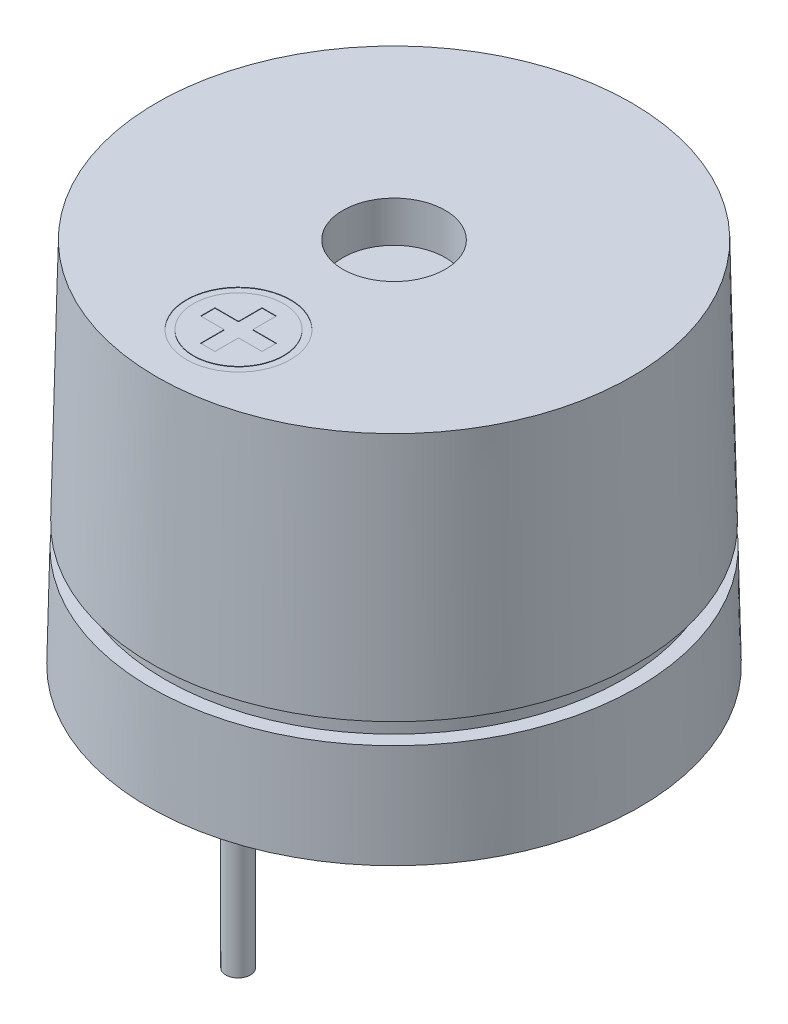
ISO-10303-21;
HEADER;
FILE_DESCRIPTION(('STEP AP214'),'2;1');
FILE_NAME('part.step','',(''),(''),'','','');
FILE_SCHEMA(('AUTOMOTIVE_DESIGN { 1 0 10303 214 1 1 1 1 }'));
ENDSEC;
DATA;
#1=APPLICATION_CONTEXT('core data for automotive mechanical design processes');
#2=APPLICATION_PROTOCOL_DEFINITION('international standard','automotive_design',2000,#1);
#3=PRODUCT_CONTEXT('',#1,'mechanical');
#4=PRODUCT('Part','Part','',(#3));
#5=PRODUCT_RELATED_PRODUCT_CATEGORY('part','',(#4));
#6=PRODUCT_DEFINITION_FORMATION('','',#4);
#7=PRODUCT_DEFINITION_CONTEXT('part definition',#1,'design');
#8=PRODUCT_DEFINITION('design','',#6,#7);
#9=PRODUCT_DEFINITION_SHAPE('','',#8);
#10=(LENGTH_UNIT() NAMED_UNIT(*) SI_UNIT(.MILLI.,.METRE.));
#11=(NAMED_UNIT(*) PLANE_ANGLE_UNIT() SI_UNIT($,.RADIAN.));
#12=(NAMED_UNIT(*) SI_UNIT($,.STERADIAN.) SOLID_ANGLE_UNIT());
#13=UNCERTAINTY_MEASURE_WITH_UNIT(LENGTH_MEASURE(1.E-05),#10,'distance_accuracy_value','');
#14=(GEOMETRIC_REPRESENTATION_CONTEXT(3) GLOBAL_UNCERTAINTY_ASSIGNED_CONTEXT((#13)) GLOBAL_UNIT_ASSIGNED_CONTEXT((#10,
#11,#12)) REPRESENTATION_CONTEXT('',''));
#15=CARTESIAN_POINT('',(0.,0.,0.));
#16=DIRECTION('',(0.,0.,1.));
#17=DIRECTION('',(1.,0.,0.));
#18=AXIS2_PLACEMENT_3D('',#15,#16,#17);
#19=CARTESIAN_POINT('',(0.,0.,0.));
#20=DIRECTION('',(0.,-1.,0.));
#21=DIRECTION('',(0.,0.,-1.));
#22=AXIS2_PLACEMENT_3D('',#19,#20,#21);
#23=CONICAL_SURFACE('',#22,6.,0.0222185653267191);
#24=CARTESIAN_POINT('',(0.,2.5,0.));
#25=DIRECTION('',(0.,-1.,0.));
#26=DIRECTION('',(1.,0.,0.));
#27=AXIS2_PLACEMENT_3D('',#24,#25,#26);
#28=CIRCLE('',#27,5.94444444444444);
#29=CARTESIAN_POINT('',(5.94444444444444,2.5,0.));
#30=VERTEX_POINT('',#29);
#31=EDGE_CURVE('E40',#30,#30,#28,.F.);
#32=ORIENTED_EDGE('',*,*,#31,.F.);
#33=EDGE_LOOP('',(#32));
#34=FACE_BOUND('',#33,.T.);
#35=CARTESIAN_POINT('',(0.,0.,0.));
#36=DIRECTION('',(0.,-1.,0.));
#37=DIRECTION('',(0.,0.,-1.));
#38=AXIS2_PLACEMENT_3D('',#35,#36,#37);
#39=CIRCLE('',#38,6.);
#40=CARTESIAN_POINT('',(0.,0.,-6.));
#41=VERTEX_POINT('',#40);
#42=EDGE_CURVE('E239',#41,#41,#39,.T.);
#43=ORIENTED_EDGE('',*,*,#42,.F.);
#44=EDGE_LOOP('',(#43));
#45=FACE_BOUND('',#44,.T.);
#46=ADVANCED_FACE('F36',(#34,#45),#23,.T.);
#47=CARTESIAN_POINT('',(0.,0.,0.));
#48=DIRECTION('',(0.,-1.,0.));
#49=DIRECTION('',(0.,0.,-1.));
#50=AXIS2_PLACEMENT_3D('',#47,#48,#49);
#51=PLANE('',#50);
#52=CARTESIAN_POINT('',(0.,0.,0.));
#53=DIRECTION('',(0.,-1.,0.));
#54=DIRECTION('',(0.,0.,-1.));
#55=AXIS2_PLACEMENT_3D('',#52,#53,#54);
#56=CIRCLE('',#55,5.4);
#57=CARTESIAN_POINT('',(0.,0.,-5.4));
#58=VERTEX_POINT('',#57);
#59=EDGE_CURVE('E230',#58,#58,#56,.T.);
#60=ORIENTED_EDGE('',*,*,#59,.F.);
#61=EDGE_LOOP('',(#60));
#62=FACE_BOUND('',#61,.T.);
#63=ORIENTED_EDGE('',*,*,#42,.T.);
#64=EDGE_LOOP('',(#63));
#65=FACE_BOUND('',#64,.T.);
#66=ADVANCED_FACE('F332',(#62,#65),#51,.T.);
#67=CARTESIAN_POINT('',(0.,0.5,0.));
#68=DIRECTION('',(0.,-1.,0.));
#69=DIRECTION('',(0.,0.,-1.));
#70=AXIS2_PLACEMENT_3D('',#67,#68,#69);
#71=CYLINDRICAL_SURFACE('',#70,5.4);
#72=CARTESIAN_POINT('',(0.,0.5,0.));
#73=DIRECTION('',(0.,-1.,0.));
#74=DIRECTION('',(0.,0.,-1.));
#75=AXIS2_PLACEMENT_3D('',#72,#73,#74);
#76=CIRCLE('',#75,5.4);
#77=CARTESIAN_POINT('',(0.,0.5,-5.4));
#78=VERTEX_POINT('',#77);
#79=EDGE_CURVE('E231',#78,#78,#76,.T.);
#80=ORIENTED_EDGE('',*,*,#79,.F.);
#81=EDGE_LOOP('',(#80));
#82=FACE_BOUND('',#81,.T.);
#83=ORIENTED_EDGE('',*,*,#59,.T.);
#84=EDGE_LOOP('',(#83));
#85=FACE_BOUND('',#84,.T.);
#86=ADVANCED_FACE('F341',(#82,#85),#71,.F.);
#87=CARTESIAN_POINT('',(0.,0.5,0.));
#88=DIRECTION('',(0.,-1.,0.));
#89=DIRECTION('',(0.,0.,-1.));
#90=AXIS2_PLACEMENT_3D('',#87,#88,#89);
#91=PLANE('',#90);
#92=CARTESIAN_POINT('',(0.,0.5,-3.81));
#93=DIRECTION('',(0.,-1.,0.));
#94=DIRECTION('',(0.,0.,-1.));
#95=AXIS2_PLACEMENT_3D('',#92,#93,#94);
#96=CIRCLE('',#95,1.25);
#97=CARTESIAN_POINT('',(0.,0.5,-5.06));
#98=VERTEX_POINT('',#97);
#99=EDGE_CURVE('E255',#98,#98,#96,.T.);
#100=ORIENTED_EDGE('',*,*,#99,.F.);
#101=EDGE_LOOP('',(#100));
#102=FACE_BOUND('',#101,.T.);
#103=CARTESIAN_POINT('',(0.,0.5,3.81));
#104=DIRECTION('',(0.,-1.,0.));
#105=DIRECTION('',(0.,0.,-1.));
#106=AXIS2_PLACEMENT_3D('',#103,#104,#105);
#107=CIRCLE('',#106,1.25);
#108=CARTESIAN_POINT('',(0.,0.5,2.56));
#109=VERTEX_POINT('',#108);
#110=EDGE_CURVE('E251',#109,#109,#107,.T.);
#111=ORIENTED_EDGE('',*,*,#110,.F.);
#112=EDGE_LOOP('',(#111));
#113=FACE_BOUND('',#112,.T.);
#114=ORIENTED_EDGE('',*,*,#79,.T.);
#115=EDGE_LOOP('',(#114));
#116=FACE_BOUND('',#115,.T.);
#117=ADVANCED_FACE('F368',(#102,#113,#116),#91,.T.);
#118=CARTESIAN_POINT('',(0.,0.5,3.81));
#119=DIRECTION('',(0.,1.,0.));
#120=DIRECTION('',(0.,0.,-1.));
#121=AXIS2_PLACEMENT_3D('',#118,#119,#120);
#122=CONICAL_SURFACE('',#121,1.25,0.78539816339745);
#123=CARTESIAN_POINT('',(0.,0.292893218813451,3.81));
#124=DIRECTION('',(0.,1.,0.));
#125=DIRECTION('',(0.,0.,1.));
#126=AXIS2_PLACEMENT_3D('',#123,#124,#125);
#127=CIRCLE('',#126,1.04289321881345);
#128=CARTESIAN_POINT('',(0.,0.292893218813451,4.85289321881345));
#129=VERTEX_POINT('',#128);
#130=EDGE_CURVE('E258',#129,#129,#127,.T.);
#131=ORIENTED_EDGE('',*,*,#130,.T.);
#132=EDGE_LOOP('',(#131));
#133=FACE_BOUND('',#132,.T.);
#134=ORIENTED_EDGE('',*,*,#110,.T.);
#135=EDGE_LOOP('',(#134));
#136=FACE_BOUND('',#135,.T.);
#137=ADVANCED_FACE('F372',(#133,#136),#122,.T.);
#138=CARTESIAN_POINT('',(0.,0.,3.81));
#139=DIRECTION('',(0.,-1.,0.));
#140=DIRECTION('',(0.,0.,-1.));
#141=AXIS2_PLACEMENT_3D('',#138,#139,#140);
#142=PLANE('',#141);
#143=CARTESIAN_POINT('',(0.,0.,3.81));
#144=DIRECTION('',(0.,-1.,0.));
#145=DIRECTION('',(0.,0.,-1.));
#146=AXIS2_PLACEMENT_3D('',#143,#144,#145);
#147=CIRCLE('',#146,0.335786437626904);
#148=CARTESIAN_POINT('',(0.,0.,3.4742135623731));
#149=VERTEX_POINT('',#148);
#150=EDGE_CURVE('E242',#149,#149,#147,.T.);
#151=ORIENTED_EDGE('',*,*,#150,.T.);
#152=EDGE_LOOP('',(#151));
#153=FACE_BOUND('',#152,.T.);
#154=CARTESIAN_POINT('',(0.,0.,3.81));
#155=DIRECTION('',(0.,-1.,0.));
#156=DIRECTION('',(0.,0.,-1.));
#157=AXIS2_PLACEMENT_3D('',#154,#155,#156);
#158=CIRCLE('',#157,0.3);
#159=CARTESIAN_POINT('',(0.,0.,3.51));
#160=VERTEX_POINT('',#159);
#161=EDGE_CURVE('E247',#160,#160,#158,.T.);
#162=ORIENTED_EDGE('',*,*,#161,.F.);
#163=EDGE_LOOP('',(#162));
#164=FACE_BOUND('',#163,.T.);
#165=ADVANCED_FACE('F392',(#153,#164),#142,.T.);
#166=CARTESIAN_POINT('',(0.,-4.5,3.81));
#167=DIRECTION('',(0.,-1.,0.));
#168=DIRECTION('',(0.,0.,-1.));
#169=AXIS2_PLACEMENT_3D('',#166,#167,#168);
#170=PLANE('',#169);
#171=CARTESIAN_POINT('',(0.,-4.5,3.81));
#172=DIRECTION('',(0.,-1.,0.));
#173=DIRECTION('',(0.,0.,-1.));
#174=AXIS2_PLACEMENT_3D('',#171,#172,#173);
#175=CIRCLE('',#174,0.3);
#176=CARTESIAN_POINT('',(0.,-4.5,3.51));
#177=VERTEX_POINT('',#176);
#178=EDGE_CURVE('E222',#177,#177,#175,.T.);
#179=ORIENTED_EDGE('',*,*,#178,.T.);
#180=EDGE_LOOP('',(#179));
#181=FACE_BOUND('',#180,.T.);
#182=ADVANCED_FACE('F388',(#181),#170,.T.);
#183=CARTESIAN_POINT('',(0.,-4.5,3.81));
#184=DIRECTION('',(0.,1.,0.));
#185=DIRECTION('',(0.,0.,1.));
#186=AXIS2_PLACEMENT_3D('',#183,#184,#185);
#187=CYLINDRICAL_SURFACE('',#186,0.3);
#188=ORIENTED_EDGE('',*,*,#161,.T.);
#189=EDGE_LOOP('',(#188));
#190=FACE_BOUND('',#189,.T.);
#191=ORIENTED_EDGE('',*,*,#178,.F.);
#192=EDGE_LOOP('',(#191));
#193=FACE_BOUND('',#192,.T.);
#194=ADVANCED_FACE('F384',(#190,#193),#187,.T.);
#195=CARTESIAN_POINT('',(0.,0.5,-3.81));
#196=DIRECTION('',(0.,1.,0.));
#197=DIRECTION('',(0.,0.,-1.));
#198=AXIS2_PLACEMENT_3D('',#195,#196,#197);
#199=CONICAL_SURFACE('',#198,1.25,0.78539816339745);
#200=CARTESIAN_POINT('',(0.,0.292893218813451,-3.81));
#201=DIRECTION('',(0.,1.,0.));
#202=DIRECTION('',(0.,0.,1.));
#203=AXIS2_PLACEMENT_3D('',#200,#201,#202);
#204=CIRCLE('',#203,1.04289321881345);
#205=CARTESIAN_POINT('',(0.,0.292893218813451,-2.76710678118655));
#206=VERTEX_POINT('',#205);
#207=EDGE_CURVE('E11',#206,#206,#204,.T.);
#208=ORIENTED_EDGE('',*,*,#207,.T.);
#209=EDGE_LOOP('',(#208));
#210=FACE_BOUND('',#209,.T.);
#211=ORIENTED_EDGE('',*,*,#99,.T.);
#212=EDGE_LOOP('',(#211));
#213=FACE_BOUND('',#212,.T.);
#214=ADVANCED_FACE('F387',(#210,#213),#199,.T.);
#215=CARTESIAN_POINT('',(0.,0.,-3.81));
#216=DIRECTION('',(0.,-1.,0.));
#217=DIRECTION('',(0.,0.,-1.));
#218=AXIS2_PLACEMENT_3D('',#215,#216,#217);
#219=PLANE('',#218);
#220=CARTESIAN_POINT('',(0.,0.,-3.81));
#221=DIRECTION('',(0.,-1.,0.));
#222=DIRECTION('',(0.,0.,-1.));
#223=AXIS2_PLACEMENT_3D('',#220,#221,#222);
#224=CIRCLE('',#223,0.335786437626904);
#225=CARTESIAN_POINT('',(0.,0.,-4.1457864376269));
#226=VERTEX_POINT('',#225);
#227=EDGE_CURVE('E45',#226,#226,#224,.T.);
#228=ORIENTED_EDGE('',*,*,#227,.T.);
#229=EDGE_LOOP('',(#228));
#230=FACE_BOUND('',#229,.T.);
#231=CARTESIAN_POINT('',(0.,0.,-3.81));
#232=DIRECTION('',(0.,-1.,0.));
#233=DIRECTION('',(0.,0.,-1.));
#234=AXIS2_PLACEMENT_3D('',#231,#232,#233);
#235=CIRCLE('',#234,0.3);
#236=CARTESIAN_POINT('',(0.,0.,-4.11));
#237=VERTEX_POINT('',#236);
#238=EDGE_CURVE('E252',#237,#237,#235,.T.);
#239=ORIENTED_EDGE('',*,*,#238,.F.);
#240=EDGE_LOOP('',(#239));
#241=FACE_BOUND('',#240,.T.);
#242=ADVANCED_FACE('F382',(#230,#241),#219,.T.);
#243=CARTESIAN_POINT('',(0.,-4.5,-3.81));
#244=DIRECTION('',(0.,-1.,0.));
#245=DIRECTION('',(0.,0.,-1.));
#246=AXIS2_PLACEMENT_3D('',#243,#244,#245);
#247=PLANE('',#246);
#248=CARTESIAN_POINT('',(0.,-4.5,-3.81));
#249=DIRECTION('',(0.,-1.,0.));
#250=DIRECTION('',(0.,0.,-1.));
#251=AXIS2_PLACEMENT_3D('',#248,#249,#250);
#252=CIRCLE('',#251,0.3);
#253=CARTESIAN_POINT('',(0.,-4.5,-4.11));
#254=VERTEX_POINT('',#253);
#255=EDGE_CURVE('E227',#254,#254,#252,.T.);
#256=ORIENTED_EDGE('',*,*,#255,.T.);
#257=EDGE_LOOP('',(#256));
#258=FACE_BOUND('',#257,.T.);
#259=ADVANCED_FACE('F378',(#258),#247,.T.);
#260=CARTESIAN_POINT('',(0.,-4.5,-3.81));
#261=DIRECTION('',(0.,1.,0.));
#262=DIRECTION('',(0.,0.,1.));
#263=AXIS2_PLACEMENT_3D('',#260,#261,#262);
#264=CYLINDRICAL_SURFACE('',#263,0.3);
#265=ORIENTED_EDGE('',*,*,#238,.T.);
#266=EDGE_LOOP('',(#265));
#267=FACE_BOUND('',#266,.T.);
#268=ORIENTED_EDGE('',*,*,#255,.F.);
#269=EDGE_LOOP('',(#268));
#270=FACE_BOUND('',#269,.T.);
#271=ADVANCED_FACE('F374',(#267,#270),#264,.T.);
#272=CARTESIAN_POINT('',(0.,1.,3.81));
#273=DIRECTION('',(0.,-1.,0.));
#274=DIRECTION('',(0.,0.,-1.));
#275=AXIS2_PLACEMENT_3D('',#272,#273,#274);
#276=DEGENERATE_TOROIDAL_SURFACE('',#275,0.335786437626904,1.,.T.);
#277=ORIENTED_EDGE('',*,*,#130,.F.);
#278=EDGE_LOOP('',(#277));
#279=FACE_BOUND('',#278,.T.);
#280=ORIENTED_EDGE('',*,*,#150,.F.);
#281=EDGE_LOOP('',(#280));
#282=FACE_BOUND('',#281,.T.);
#283=ADVANCED_FACE('F377',(#279,#282),#276,.T.);
#284=CARTESIAN_POINT('',(0.,1.,-3.81));
#285=DIRECTION('',(0.,-1.,0.));
#286=DIRECTION('',(0.,0.,-1.));
#287=AXIS2_PLACEMENT_3D('',#284,#285,#286);
#288=DEGENERATE_TOROIDAL_SURFACE('',#287,0.335786437626904,1.,.T.);
#289=ORIENTED_EDGE('',*,*,#207,.F.);
#290=EDGE_LOOP('',(#289));
#291=FACE_BOUND('',#290,.T.);
#292=ORIENTED_EDGE('',*,*,#227,.F.);
#293=EDGE_LOOP('',(#292));
#294=FACE_BOUND('',#293,.T.);
#295=ADVANCED_FACE('F38',(#291,#294),#288,.T.);
#296=CARTESIAN_POINT('',(0.,0.,0.));
#297=DIRECTION('',(0.,-1.,0.));
#298=DIRECTION('',(1.,0.,0.));
#299=AXIS2_PLACEMENT_3D('',#296,#297,#298);
#300=CYLINDRICAL_SURFACE('',#299,5.6);
#301=CARTESIAN_POINT('',(0.,2.5,0.));
#302=DIRECTION('',(0.,-1.,0.));
#303=DIRECTION('',(1.,0.,0.));
#304=AXIS2_PLACEMENT_3D('',#301,#302,#303);
#305=CIRCLE('',#304,5.6);
#306=CARTESIAN_POINT('',(5.6,2.5,0.));
#307=VERTEX_POINT('',#306);
#308=EDGE_CURVE('E264',#307,#307,#305,.T.);
#309=ORIENTED_EDGE('',*,*,#308,.F.);
#310=EDGE_LOOP('',(#309));
#311=FACE_BOUND('',#310,.T.);
#312=CARTESIAN_POINT('',(0.,3.,0.));
#313=DIRECTION('',(0.,-1.,0.));
#314=DIRECTION('',(1.,0.,0.));
#315=AXIS2_PLACEMENT_3D('',#312,#313,#314);
#316=CIRCLE('',#315,5.6);
#317=CARTESIAN_POINT('',(5.6,3.,0.));
#318=VERTEX_POINT('',#317);
#319=EDGE_CURVE('E269',#318,#318,#316,.T.);
#320=ORIENTED_EDGE('',*,*,#319,.T.);
#321=EDGE_LOOP('',(#320));
#322=FACE_BOUND('',#321,.T.);
#323=ADVANCED_FACE('F574',(#311,#322),#300,.T.);
#324=CARTESIAN_POINT('',(5.6,2.5,0.));
#325=DIRECTION('',(0.,-1.,0.));
#326=DIRECTION('',(1.,0.,0.));
#327=AXIS2_PLACEMENT_3D('',#324,#325,#326);
#328=PLANE('',#327);
#329=ORIENTED_EDGE('',*,*,#31,.T.);
#330=EDGE_LOOP('',(#329));
#331=FACE_BOUND('',#330,.T.);
#332=ORIENTED_EDGE('',*,*,#308,.T.);
#333=EDGE_LOOP('',(#332));
#334=FACE_BOUND('',#333,.T.);
#335=ADVANCED_FACE('F589',(#331,#334),#328,.F.);
#336=CARTESIAN_POINT('',(5.6,3.,0.));
#337=DIRECTION('',(0.,1.,0.));
#338=DIRECTION('',(-1.,0.,0.));
#339=AXIS2_PLACEMENT_3D('',#336,#337,#338);
#340=PLANE('',#339);
#341=CARTESIAN_POINT('',(0.,3.,0.));
#342=DIRECTION('',(0.,1.,0.));
#343=DIRECTION('',(-1.,0.,0.));
#344=AXIS2_PLACEMENT_3D('',#341,#342,#343);
#345=CIRCLE('',#344,5.93333333333333);
#346=CARTESIAN_POINT('',(-5.93333333333333,3.,0.));
#347=VERTEX_POINT('',#346);
#348=EDGE_CURVE('E262',#347,#347,#345,.F.);
#349=ORIENTED_EDGE('',*,*,#348,.T.);
#350=EDGE_LOOP('',(#349));
#351=FACE_BOUND('',#350,.T.);
#352=ORIENTED_EDGE('',*,*,#319,.F.);
#353=EDGE_LOOP('',(#352));
#354=FACE_BOUND('',#353,.T.);
#355=ADVANCED_FACE('F427',(#351,#354),#340,.F.);
#356=CARTESIAN_POINT('',(0.,8.99,0.));
#357=DIRECTION('',(0.,-1.,0.));
#358=DIRECTION('',(0.,0.,-1.));
#359=AXIS2_PLACEMENT_3D('',#356,#357,#358);
#360=PLANE('',#359);
#361=DIRECTION('',(0.,0.,1.));
#362=VECTOR('',#361,1.);
#363=CARTESIAN_POINT('',(-0.175,8.99,3.625));
#364=LINE('',#363,#362);
#365=CARTESIAN_POINT('',(-0.175,8.99,3.05));
#366=VERTEX_POINT('',#365);
#367=CARTESIAN_POINT('',(-0.175,8.99,3.625));
#368=VERTEX_POINT('',#367);
#369=EDGE_CURVE('E193',#366,#368,#364,.T.);
#370=ORIENTED_EDGE('',*,*,#369,.T.);
#371=DIRECTION('',(-1.,0.,0.));
#372=VECTOR('',#371,1.);
#373=CARTESIAN_POINT('',(-0.75,8.99,3.625));
#374=LINE('',#373,#372);
#375=CARTESIAN_POINT('',(-0.75,8.99,3.625));
#376=VERTEX_POINT('',#375);
#377=EDGE_CURVE('E287',#368,#376,#374,.T.);
#378=ORIENTED_EDGE('',*,*,#377,.T.);
#379=DIRECTION('',(0.,0.,1.));
#380=VECTOR('',#379,1.);
#381=CARTESIAN_POINT('',(-0.75,8.99,3.625));
#382=LINE('',#381,#380);
#383=CARTESIAN_POINT('',(-0.75,8.99,3.975));
#384=VERTEX_POINT('',#383);
#385=EDGE_CURVE('E290',#376,#384,#382,.T.);
#386=ORIENTED_EDGE('',*,*,#385,.T.);
#387=DIRECTION('',(1.,0.,0.));
#388=VECTOR('',#387,1.);
#389=CARTESIAN_POINT('',(-0.75,8.99,3.975));
#390=LINE('',#389,#388);
#391=CARTESIAN_POINT('',(-0.175,8.99,3.975));
#392=VERTEX_POINT('',#391);
#393=EDGE_CURVE('E293',#384,#392,#390,.T.);
#394=ORIENTED_EDGE('',*,*,#393,.T.);
#395=DIRECTION('',(0.,0.,1.));
#396=VECTOR('',#395,1.);
#397=CARTESIAN_POINT('',(-0.175,8.99,3.975));
#398=LINE('',#397,#396);
#399=CARTESIAN_POINT('',(-0.175,8.99,4.55));
#400=VERTEX_POINT('',#399);
#401=EDGE_CURVE('E296',#392,#400,#398,.T.);
#402=ORIENTED_EDGE('',*,*,#401,.T.);
#403=DIRECTION('',(1.,0.,0.));
#404=VECTOR('',#403,1.);
#405=CARTESIAN_POINT('',(-0.175,8.99,4.55));
#406=LINE('',#405,#404);
#407=CARTESIAN_POINT('',(0.175,8.99,4.55));
#408=VERTEX_POINT('',#407);
#409=EDGE_CURVE('E299',#400,#408,#406,.T.);
#410=ORIENTED_EDGE('',*,*,#409,.T.);
#411=DIRECTION('',(0.,0.,-1.));
#412=VECTOR('',#411,1.);
#413=CARTESIAN_POINT('',(0.175,8.99,3.975));
#414=LINE('',#413,#412);
#415=CARTESIAN_POINT('',(0.175,8.99,3.975));
#416=VERTEX_POINT('',#415);
#417=EDGE_CURVE('E302',#408,#416,#414,.T.);
#418=ORIENTED_EDGE('',*,*,#417,.T.);
#419=DIRECTION('',(1.,0.,0.));
#420=VECTOR('',#419,1.);
#421=CARTESIAN_POINT('',(0.75,8.99,3.975));
#422=LINE('',#421,#420);
#423=CARTESIAN_POINT('',(0.75,8.99,3.975));
#424=VERTEX_POINT('',#423);
#425=EDGE_CURVE('E157',#416,#424,#422,.T.);
#426=ORIENTED_EDGE('',*,*,#425,.T.);
#427=DIRECTION('',(0.,0.,-1.));
#428=VECTOR('',#427,1.);
#429=CARTESIAN_POINT('',(0.75,8.99,3.625));
#430=LINE('',#429,#428);
#431=CARTESIAN_POINT('',(0.75,8.99,3.625));
#432=VERTEX_POINT('',#431);
#433=EDGE_CURVE('E155',#424,#432,#430,.T.);
#434=ORIENTED_EDGE('',*,*,#433,.T.);
#435=DIRECTION('',(-1.,0.,0.));
#436=VECTOR('',#435,1.);
#437=CARTESIAN_POINT('',(0.175,8.99,3.625));
#438=LINE('',#437,#436);
#439=CARTESIAN_POINT('',(0.175,8.99,3.625));
#440=VERTEX_POINT('',#439);
#441=EDGE_CURVE('E134',#432,#440,#438,.T.);
#442=ORIENTED_EDGE('',*,*,#441,.T.);
#443=DIRECTION('',(0.,0.,-1.));
#444=VECTOR('',#443,1.);
#445=CARTESIAN_POINT('',(0.175,8.99,3.05));
#446=LINE('',#445,#444);
#447=CARTESIAN_POINT('',(0.175,8.99,3.05));
#448=VERTEX_POINT('',#447);
#449=EDGE_CURVE('E145',#440,#448,#446,.T.);
#450=ORIENTED_EDGE('',*,*,#449,.T.);
#451=DIRECTION('',(-1.,0.,0.));
#452=VECTOR('',#451,1.);
#453=CARTESIAN_POINT('',(-0.175,8.99,3.05));
#454=LINE('',#453,#452);
#455=EDGE_CURVE('E149',#448,#366,#454,.T.);
#456=ORIENTED_EDGE('',*,*,#455,.T.);
#457=EDGE_LOOP('',(#370,#378,#386,#394,#402,#410,#418,#426,#434,#442,#450,#456));
#458=FACE_BOUND('',#457,.T.);
#459=ADVANCED_FACE('F152',(#458),#360,.F.);
#460=CARTESIAN_POINT('',(-0.75,8.99,3.625));
#461=DIRECTION('',(0.,0.,-1.));
#462=DIRECTION('',(-1.,0.,0.));
#463=AXIS2_PLACEMENT_3D('',#460,#461,#462);
#464=PLANE('',#463);
#465=DIRECTION('',(-1.,0.,0.));
#466=VECTOR('',#465,1.);
#467=CARTESIAN_POINT('',(-0.75,9.,3.625));
#468=LINE('',#467,#466);
#469=CARTESIAN_POINT('',(-0.175,9.,3.625));
#470=VERTEX_POINT('',#469);
#471=CARTESIAN_POINT('',(-0.75,9.,3.625));
#472=VERTEX_POINT('',#471);
#473=EDGE_CURVE('E163',#470,#472,#468,.T.);
#474=ORIENTED_EDGE('',*,*,#473,.T.);
#475=DIRECTION('',(0.,1.,0.));
#476=VECTOR('',#475,1.);
#477=CARTESIAN_POINT('',(-0.75,8.99,3.625));
#478=LINE('',#477,#476);
#479=EDGE_CURVE('E210',#376,#472,#478,.T.);
#480=ORIENTED_EDGE('',*,*,#479,.F.);
#481=ORIENTED_EDGE('',*,*,#377,.F.);
#482=DIRECTION('',(0.,1.,0.));
#483=VECTOR('',#482,1.);
#484=CARTESIAN_POINT('',(-0.175,8.99,3.625));
#485=LINE('',#484,#483);
#486=EDGE_CURVE('E101',#368,#470,#485,.T.);
#487=ORIENTED_EDGE('',*,*,#486,.T.);
#488=EDGE_LOOP('',(#474,#480,#481,#487));
#489=FACE_BOUND('',#488,.T.);
#490=ADVANCED_FACE('F426',(#489),#464,.F.);
#491=CARTESIAN_POINT('',(-0.75,8.99,3.625));
#492=DIRECTION('',(-1.,0.,0.));
#493=DIRECTION('',(0.,0.,1.));
#494=AXIS2_PLACEMENT_3D('',#491,#492,#493);
#495=PLANE('',#494);
#496=DIRECTION('',(0.,0.,1.));
#497=VECTOR('',#496,1.);
#498=CARTESIAN_POINT('',(-0.75,9.,3.625));
#499=LINE('',#498,#497);
#500=CARTESIAN_POINT('',(-0.75,9.,3.975));
#501=VERTEX_POINT('',#500);
#502=EDGE_CURVE('E167',#472,#501,#499,.T.);
#503=ORIENTED_EDGE('',*,*,#502,.T.);
#504=DIRECTION('',(0.,1.,0.));
#505=VECTOR('',#504,1.);
#506=CARTESIAN_POINT('',(-0.75,8.99,3.975));
#507=LINE('',#506,#505);
#508=EDGE_CURVE('E208',#384,#501,#507,.T.);
#509=ORIENTED_EDGE('',*,*,#508,.F.);
#510=ORIENTED_EDGE('',*,*,#385,.F.);
#511=ORIENTED_EDGE('',*,*,#479,.T.);
#512=EDGE_LOOP('',(#503,#509,#510,#511));
#513=FACE_BOUND('',#512,.T.);
#514=ADVANCED_FACE('F452',(#513),#495,.F.);
#515=CARTESIAN_POINT('',(-0.75,8.99,3.975));
#516=DIRECTION('',(0.,0.,1.));
#517=DIRECTION('',(1.,0.,0.));
#518=AXIS2_PLACEMENT_3D('',#515,#516,#517);
#519=PLANE('',#518);
#520=DIRECTION('',(1.,0.,0.));
#521=VECTOR('',#520,1.);
#522=CARTESIAN_POINT('',(-0.75,9.,3.975));
#523=LINE('',#522,#521);
#524=CARTESIAN_POINT('',(-0.175,9.,3.975));
#525=VERTEX_POINT('',#524);
#526=EDGE_CURVE('E170',#501,#525,#523,.T.);
#527=ORIENTED_EDGE('',*,*,#526,.T.);
#528=DIRECTION('',(0.,1.,0.));
#529=VECTOR('',#528,1.);
#530=CARTESIAN_POINT('',(-0.175,8.99,3.975));
#531=LINE('',#530,#529);
#532=EDGE_CURVE('E206',#392,#525,#531,.T.);
#533=ORIENTED_EDGE('',*,*,#532,.F.);
#534=ORIENTED_EDGE('',*,*,#393,.F.);
#535=ORIENTED_EDGE('',*,*,#508,.T.);
#536=EDGE_LOOP('',(#527,#533,#534,#535));
#537=FACE_BOUND('',#536,.T.);
#538=ADVANCED_FACE('F448',(#537),#519,.F.);
#539=CARTESIAN_POINT('',(-0.175,8.99,3.975));
#540=DIRECTION('',(-1.,0.,0.));
#541=DIRECTION('',(0.,0.,1.));
#542=AXIS2_PLACEMENT_3D('',#539,#540,#541);
#543=PLANE('',#542);
#544=DIRECTION('',(0.,0.,1.));
#545=VECTOR('',#544,1.);
#546=CARTESIAN_POINT('',(-0.175,9.,3.975));
#547=LINE('',#546,#545);
#548=CARTESIAN_POINT('',(-0.175,9.,4.55));
#549=VERTEX_POINT('',#548);
#550=EDGE_CURVE('E173',#525,#549,#547,.T.);
#551=ORIENTED_EDGE('',*,*,#550,.T.);
#552=DIRECTION('',(0.,1.,0.));
#553=VECTOR('',#552,1.);
#554=CARTESIAN_POINT('',(-0.175,8.99,4.55));
#555=LINE('',#554,#553);
#556=EDGE_CURVE('E204',#400,#549,#555,.T.);
#557=ORIENTED_EDGE('',*,*,#556,.F.);
#558=ORIENTED_EDGE('',*,*,#401,.F.);
#559=ORIENTED_EDGE('',*,*,#532,.T.);
#560=EDGE_LOOP('',(#551,#557,#558,#559));
#561=FACE_BOUND('',#560,.T.);
#562=ADVANCED_FACE('F444',(#561),#543,.F.);
#563=CARTESIAN_POINT('',(-0.175,8.99,4.55));
#564=DIRECTION('',(0.,0.,1.));
#565=DIRECTION('',(1.,0.,0.));
#566=AXIS2_PLACEMENT_3D('',#563,#564,#565);
#567=PLANE('',#566);
#568=DIRECTION('',(1.,0.,0.));
#569=VECTOR('',#568,1.);
#570=CARTESIAN_POINT('',(-0.175,9.,4.55));
#571=LINE('',#570,#569);
#572=CARTESIAN_POINT('',(0.175,9.,4.55));
#573=VERTEX_POINT('',#572);
#574=EDGE_CURVE('E176',#549,#573,#571,.T.);
#575=ORIENTED_EDGE('',*,*,#574,.T.);
#576=DIRECTION('',(0.,1.,0.));
#577=VECTOR('',#576,1.);
#578=CARTESIAN_POINT('',(0.175,8.99,4.55));
#579=LINE('',#578,#577);
#580=EDGE_CURVE('E202',#408,#573,#579,.T.);
#581=ORIENTED_EDGE('',*,*,#580,.F.);
#582=ORIENTED_EDGE('',*,*,#409,.F.);
#583=ORIENTED_EDGE('',*,*,#556,.T.);
#584=EDGE_LOOP('',(#575,#581,#582,#583));
#585=FACE_BOUND('',#584,.T.);
#586=ADVANCED_FACE('F440',(#585),#567,.F.);
#587=CARTESIAN_POINT('',(0.175,8.99,3.975));
#588=DIRECTION('',(1.,0.,0.));
#589=DIRECTION('',(0.,0.,-1.));
#590=AXIS2_PLACEMENT_3D('',#587,#588,#589);
#591=PLANE('',#590);
#592=DIRECTION('',(0.,0.,-1.));
#593=VECTOR('',#592,1.);
#594=CARTESIAN_POINT('',(0.175,9.,3.975));
#595=LINE('',#594,#593);
#596=CARTESIAN_POINT('',(0.175,9.,3.975));
#597=VERTEX_POINT('',#596);
#598=EDGE_CURVE('E179',#573,#597,#595,.T.);
#599=ORIENTED_EDGE('',*,*,#598,.T.);
#600=DIRECTION('',(0.,1.,0.));
#601=VECTOR('',#600,1.);
#602=CARTESIAN_POINT('',(0.175,8.99,3.975));
#603=LINE('',#602,#601);
#604=EDGE_CURVE('E200',#416,#597,#603,.T.);
#605=ORIENTED_EDGE('',*,*,#604,.F.);
#606=ORIENTED_EDGE('',*,*,#417,.F.);
#607=ORIENTED_EDGE('',*,*,#580,.T.);
#608=EDGE_LOOP('',(#599,#605,#606,#607));
#609=FACE_BOUND('',#608,.T.);
#610=ADVANCED_FACE('F437',(#609),#591,.F.);
#611=CARTESIAN_POINT('',(0.75,8.99,3.975));
#612=DIRECTION('',(0.,0.,1.));
#613=DIRECTION('',(1.,0.,0.));
#614=AXIS2_PLACEMENT_3D('',#611,#612,#613);
#615=PLANE('',#614);
#616=DIRECTION('',(1.,0.,0.));
#617=VECTOR('',#616,1.);
#618=CARTESIAN_POINT('',(0.75,9.,3.975));
#619=LINE('',#618,#617);
#620=CARTESIAN_POINT('',(0.75,9.,3.975));
#621=VERTEX_POINT('',#620);
#622=EDGE_CURVE('E182',#597,#621,#619,.T.);
#623=ORIENTED_EDGE('',*,*,#622,.T.);
#624=DIRECTION('',(0.,1.,0.));
#625=VECTOR('',#624,1.);
#626=CARTESIAN_POINT('',(0.75,8.99,3.975));
#627=LINE('',#626,#625);
#628=EDGE_CURVE('E198',#424,#621,#627,.T.);
#629=ORIENTED_EDGE('',*,*,#628,.F.);
#630=ORIENTED_EDGE('',*,*,#425,.F.);
#631=ORIENTED_EDGE('',*,*,#604,.T.);
#632=EDGE_LOOP('',(#623,#629,#630,#631));
#633=FACE_BOUND('',#632,.T.);
#634=ADVANCED_FACE('F307',(#633),#615,.F.);
#635=CARTESIAN_POINT('',(0.75,8.99,3.625));
#636=DIRECTION('',(1.,0.,0.));
#637=DIRECTION('',(0.,0.,-1.));
#638=AXIS2_PLACEMENT_3D('',#635,#636,#637);
#639=PLANE('',#638);
#640=DIRECTION('',(0.,0.,-1.));
#641=VECTOR('',#640,1.);
#642=CARTESIAN_POINT('',(0.75,9.,3.625));
#643=LINE('',#642,#641);
#644=CARTESIAN_POINT('',(0.75,9.,3.625));
#645=VERTEX_POINT('',#644);
#646=EDGE_CURVE('E185',#621,#645,#643,.T.);
#647=ORIENTED_EDGE('',*,*,#646,.T.);
#648=DIRECTION('',(0.,1.,0.));
#649=VECTOR('',#648,1.);
#650=CARTESIAN_POINT('',(0.75,8.99,3.625));
#651=LINE('',#650,#649);
#652=EDGE_CURVE('E142',#432,#645,#651,.T.);
#653=ORIENTED_EDGE('',*,*,#652,.F.);
#654=ORIENTED_EDGE('',*,*,#433,.F.);
#655=ORIENTED_EDGE('',*,*,#628,.T.);
#656=EDGE_LOOP('',(#647,#653,#654,#655));
#657=FACE_BOUND('',#656,.T.);
#658=ADVANCED_FACE('F311',(#657),#639,.F.);
#659=CARTESIAN_POINT('',(0.175,8.99,3.625));
#660=DIRECTION('',(0.,0.,-1.));
#661=DIRECTION('',(-1.,0.,0.));
#662=AXIS2_PLACEMENT_3D('',#659,#660,#661);
#663=PLANE('',#662);
#664=DIRECTION('',(-1.,0.,0.));
#665=VECTOR('',#664,1.);
#666=CARTESIAN_POINT('',(0.175,9.,3.625));
#667=LINE('',#666,#665);
#668=CARTESIAN_POINT('',(0.175,9.,3.625));
#669=VERTEX_POINT('',#668);
#670=EDGE_CURVE('E137',#645,#669,#667,.T.);
#671=ORIENTED_EDGE('',*,*,#670,.T.);
#672=DIRECTION('',(0.,1.,0.));
#673=VECTOR('',#672,1.);
#674=CARTESIAN_POINT('',(0.175,8.99,3.625));
#675=LINE('',#674,#673);
#676=EDGE_CURVE('E130',#440,#669,#675,.T.);
#677=ORIENTED_EDGE('',*,*,#676,.F.);
#678=ORIENTED_EDGE('',*,*,#441,.F.);
#679=ORIENTED_EDGE('',*,*,#652,.T.);
#680=EDGE_LOOP('',(#671,#677,#678,#679));
#681=FACE_BOUND('',#680,.T.);
#682=ADVANCED_FACE('F132',(#681),#663,.F.);
#683=CARTESIAN_POINT('',(0.175,8.99,3.05));
#684=DIRECTION('',(1.,0.,0.));
#685=DIRECTION('',(0.,0.,-1.));
#686=AXIS2_PLACEMENT_3D('',#683,#684,#685);
#687=PLANE('',#686);
#688=DIRECTION('',(0.,0.,-1.));
#689=VECTOR('',#688,1.);
#690=CARTESIAN_POINT('',(0.175,9.,3.05));
#691=LINE('',#690,#689);
#692=CARTESIAN_POINT('',(0.175,9.,3.05));
#693=VERTEX_POINT('',#692);
#694=EDGE_CURVE('E189',#669,#693,#691,.T.);
#695=ORIENTED_EDGE('',*,*,#694,.T.);
#696=DIRECTION('',(0.,1.,0.));
#697=VECTOR('',#696,1.);
#698=CARTESIAN_POINT('',(0.175,8.99,3.05));
#699=LINE('',#698,#697);
#700=EDGE_CURVE('E141',#448,#693,#699,.T.);
#701=ORIENTED_EDGE('',*,*,#700,.F.);
#702=ORIENTED_EDGE('',*,*,#449,.F.);
#703=ORIENTED_EDGE('',*,*,#676,.T.);
#704=EDGE_LOOP('',(#695,#701,#702,#703));
#705=FACE_BOUND('',#704,.T.);
#706=ADVANCED_FACE('F146',(#705),#687,.F.);
#707=CARTESIAN_POINT('',(-0.175,8.99,3.05));
#708=DIRECTION('',(0.,0.,-1.));
#709=DIRECTION('',(-1.,0.,0.));
#710=AXIS2_PLACEMENT_3D('',#707,#708,#709);
#711=PLANE('',#710);
#712=DIRECTION('',(-1.,0.,0.));
#713=VECTOR('',#712,1.);
#714=CARTESIAN_POINT('',(-0.175,9.,3.05));
#715=LINE('',#714,#713);
#716=CARTESIAN_POINT('',(-0.175,9.,3.05));
#717=VERTEX_POINT('',#716);
#718=EDGE_CURVE('E191',#693,#717,#715,.T.);
#719=ORIENTED_EDGE('',*,*,#718,.T.);
#720=DIRECTION('',(0.,1.,0.));
#721=VECTOR('',#720,1.);
#722=CARTESIAN_POINT('',(-0.175,8.99,3.05));
#723=LINE('',#722,#721);
#724=EDGE_CURVE('E61',#366,#717,#723,.T.);
#725=ORIENTED_EDGE('',*,*,#724,.F.);
#726=ORIENTED_EDGE('',*,*,#455,.F.);
#727=ORIENTED_EDGE('',*,*,#700,.T.);
#728=EDGE_LOOP('',(#719,#725,#726,#727));
#729=FACE_BOUND('',#728,.T.);
#730=ADVANCED_FACE('F317',(#729),#711,.F.);
#731=CARTESIAN_POINT('',(-0.175,8.99,3.625));
#732=DIRECTION('',(-1.,0.,0.));
#733=DIRECTION('',(0.,0.,1.));
#734=AXIS2_PLACEMENT_3D('',#731,#732,#733);
#735=PLANE('',#734);
#736=DIRECTION('',(0.,0.,1.));
#737=VECTOR('',#736,1.);
#738=CARTESIAN_POINT('',(-0.175,9.,3.625));
#739=LINE('',#738,#737);
#740=EDGE_CURVE('E53',#717,#470,#739,.T.);
#741=ORIENTED_EDGE('',*,*,#740,.T.);
#742=ORIENTED_EDGE('',*,*,#486,.F.);
#743=ORIENTED_EDGE('',*,*,#369,.F.);
#744=ORIENTED_EDGE('',*,*,#724,.T.);
#745=EDGE_LOOP('',(#741,#742,#743,#744));
#746=FACE_BOUND('',#745,.T.);
#747=ADVANCED_FACE('F318',(#746),#735,.F.);
#748=CARTESIAN_POINT('',(5.8,9.,0.));
#749=DIRECTION('',(0.,1.,0.));
#750=DIRECTION('',(0.,0.,1.));
#751=AXIS2_PLACEMENT_3D('',#748,#749,#750);
#752=PLANE('',#751);
#753=ORIENTED_EDGE('',*,*,#740,.F.);
#754=ORIENTED_EDGE('',*,*,#718,.F.);
#755=ORIENTED_EDGE('',*,*,#694,.F.);
#756=ORIENTED_EDGE('',*,*,#670,.F.);
#757=ORIENTED_EDGE('',*,*,#646,.F.);
#758=ORIENTED_EDGE('',*,*,#622,.F.);
#759=ORIENTED_EDGE('',*,*,#598,.F.);
#760=ORIENTED_EDGE('',*,*,#574,.F.);
#761=ORIENTED_EDGE('',*,*,#550,.F.);
#762=ORIENTED_EDGE('',*,*,#526,.F.);
#763=ORIENTED_EDGE('',*,*,#502,.F.);
#764=ORIENTED_EDGE('',*,*,#473,.F.);
#765=EDGE_LOOP('',(#753,#754,#755,#756,#757,#758,#759,#760,#761,#762,#763,#764));
#766=FACE_BOUND('',#765,.T.);
#767=CARTESIAN_POINT('',(0.,9.,3.8));
#768=DIRECTION('',(0.,1.,0.));
#769=DIRECTION('',(0.,0.,1.));
#770=AXIS2_PLACEMENT_3D('',#767,#768,#769);
#771=CIRCLE('',#770,1.1);
#772=CARTESIAN_POINT('',(0.,9.,4.9));
#773=VERTEX_POINT('',#772);
#774=EDGE_CURVE('E195',#773,#773,#771,.T.);
#775=ORIENTED_EDGE('',*,*,#774,.T.);
#776=EDGE_LOOP('',(#775));
#777=FACE_BOUND('',#776,.T.);
#778=ADVANCED_FACE('F313',(#766,#777),#752,.T.);
#779=CARTESIAN_POINT('',(0.,6.,0.));
#780=DIRECTION('',(0.,1.,0.));
#781=DIRECTION('',(0.,0.,1.));
#782=AXIS2_PLACEMENT_3D('',#779,#780,#781);
#783=PLANE('',#782);
#784=CARTESIAN_POINT('',(0.,6.,0.));
#785=DIRECTION('',(0.,1.,0.));
#786=DIRECTION('',(0.,0.,1.));
#787=AXIS2_PLACEMENT_3D('',#784,#785,#786);
#788=CIRCLE('',#787,4.5);
#789=CARTESIAN_POINT('',(0.,6.,4.5));
#790=VERTEX_POINT('',#789);
#791=EDGE_CURVE('E250',#790,#790,#788,.T.);
#792=ORIENTED_EDGE('',*,*,#791,.T.);
#793=EDGE_LOOP('',(#792));
#794=FACE_BOUND('',#793,.T.);
#795=ADVANCED_FACE('F325',(#794),#783,.T.);
#796=CARTESIAN_POINT('',(0.,8.99,3.8));
#797=DIRECTION('',(0.,1.,0.));
#798=DIRECTION('',(0.,0.,1.));
#799=AXIS2_PLACEMENT_3D('',#796,#797,#798);
#800=CYLINDRICAL_SURFACE('',#799,1.1);
#801=CARTESIAN_POINT('',(0.,8.99,3.8));
#802=DIRECTION('',(0.,1.,0.));
#803=DIRECTION('',(0.,0.,1.));
#804=AXIS2_PLACEMENT_3D('',#801,#802,#803);
#805=CIRCLE('',#804,1.1);
#806=CARTESIAN_POINT('',(0.,8.99,4.9));
#807=VERTEX_POINT('',#806);
#808=EDGE_CURVE('E213',#807,#807,#805,.T.);
#809=ORIENTED_EDGE('',*,*,#808,.T.);
#810=EDGE_LOOP('',(#809));
#811=FACE_BOUND('',#810,.T.);
#812=ORIENTED_EDGE('',*,*,#774,.F.);
#813=EDGE_LOOP('',(#812));
#814=FACE_BOUND('',#813,.T.);
#815=ADVANCED_FACE('F402',(#811,#814),#800,.T.);
#816=CARTESIAN_POINT('',(0.,8.,0.));
#817=DIRECTION('',(0.,-1.,0.));
#818=DIRECTION('',(0.,0.,-1.));
#819=AXIS2_PLACEMENT_3D('',#816,#817,#818);
#820=CYLINDRICAL_SURFACE('',#819,4.5);
#821=CARTESIAN_POINT('',(0.,8.,0.));
#822=DIRECTION('',(0.,1.,0.));
#823=DIRECTION('',(0.,0.,1.));
#824=AXIS2_PLACEMENT_3D('',#821,#822,#823);
#825=CIRCLE('',#824,4.5);
#826=CARTESIAN_POINT('',(0.,8.,4.5));
#827=VERTEX_POINT('',#826);
#828=EDGE_CURVE('E246',#827,#827,#825,.T.);
#829=ORIENTED_EDGE('',*,*,#828,.T.);
#830=EDGE_LOOP('',(#829));
#831=FACE_BOUND('',#830,.T.);
#832=ORIENTED_EDGE('',*,*,#791,.F.);
#833=EDGE_LOOP('',(#832));
#834=FACE_BOUND('',#833,.T.);
#835=ADVANCED_FACE('F400',(#831,#834),#820,.F.);
#836=CARTESIAN_POINT('',(0.,8.99,3.8));
#837=DIRECTION('',(0.,1.,0.));
#838=DIRECTION('',(0.,0.,1.));
#839=AXIS2_PLACEMENT_3D('',#836,#837,#838);
#840=PLANE('',#839);
#841=ORIENTED_EDGE('',*,*,#808,.F.);
#842=EDGE_LOOP('',(#841));
#843=FACE_BOUND('',#842,.T.);
#844=CARTESIAN_POINT('',(0.,8.99,3.8));
#845=DIRECTION('',(0.,1.,0.));
#846=DIRECTION('',(0.,0.,1.));
#847=AXIS2_PLACEMENT_3D('',#844,#845,#846);
#848=CIRCLE('',#847,1.27);
#849=CARTESIAN_POINT('',(0.,8.99,5.07));
#850=VERTEX_POINT('',#849);
#851=EDGE_CURVE('E219',#850,#850,#848,.T.);
#852=ORIENTED_EDGE('',*,*,#851,.T.);
#853=EDGE_LOOP('',(#852));
#854=FACE_BOUND('',#853,.T.);
#855=ADVANCED_FACE('F398',(#843,#854),#840,.T.);
#856=CARTESIAN_POINT('',(0.,8.,0.));
#857=DIRECTION('',(0.,1.,0.));
#858=DIRECTION('',(0.,0.,1.));
#859=AXIS2_PLACEMENT_3D('',#856,#857,#858);
#860=PLANE('',#859);
#861=ORIENTED_EDGE('',*,*,#828,.F.);
#862=EDGE_LOOP('',(#861));
#863=FACE_BOUND('',#862,.T.);
#864=CARTESIAN_POINT('',(0.,8.,0.));
#865=DIRECTION('',(0.,1.,0.));
#866=DIRECTION('',(0.,0.,1.));
#867=AXIS2_PLACEMENT_3D('',#864,#865,#866);
#868=CIRCLE('',#867,1.25);
#869=CARTESIAN_POINT('',(0.,8.,1.25));
#870=VERTEX_POINT('',#869);
#871=EDGE_CURVE('E243',#870,#870,#868,.F.);
#872=ORIENTED_EDGE('',*,*,#871,.F.);
#873=EDGE_LOOP('',(#872));
#874=FACE_BOUND('',#873,.T.);
#875=ADVANCED_FACE('F396',(#863,#874),#860,.F.);
#876=CARTESIAN_POINT('',(0.,8.99,3.8));
#877=DIRECTION('',(0.,1.,0.));
#878=DIRECTION('',(0.,0.,1.));
#879=AXIS2_PLACEMENT_3D('',#876,#877,#878);
#880=CYLINDRICAL_SURFACE('',#879,1.27);
#881=ORIENTED_EDGE('',*,*,#851,.F.);
#882=EDGE_LOOP('',(#881));
#883=FACE_BOUND('',#882,.T.);
#884=CARTESIAN_POINT('',(0.,9.,3.8));
#885=DIRECTION('',(0.,1.,0.));
#886=DIRECTION('',(0.,0.,1.));
#887=AXIS2_PLACEMENT_3D('',#884,#885,#886);
#888=CIRCLE('',#887,1.27);
#889=CARTESIAN_POINT('',(0.,9.,5.07));
#890=VERTEX_POINT('',#889);
#891=EDGE_CURVE('E216',#890,#890,#888,.T.);
#892=ORIENTED_EDGE('',*,*,#891,.T.);
#893=EDGE_LOOP('',(#892));
#894=FACE_BOUND('',#893,.T.);
#895=ADVANCED_FACE('F361',(#883,#894),#880,.F.);
#896=CARTESIAN_POINT('',(0.,6.,0.));
#897=DIRECTION('',(0.,1.,0.));
#898=DIRECTION('',(0.,0.,1.));
#899=AXIS2_PLACEMENT_3D('',#896,#897,#898);
#900=CYLINDRICAL_SURFACE('',#899,1.25);
#901=ORIENTED_EDGE('',*,*,#871,.T.);
#902=EDGE_LOOP('',(#901));
#903=FACE_BOUND('',#902,.T.);
#904=CARTESIAN_POINT('',(0.,9.,0.));
#905=DIRECTION('',(0.,1.,0.));
#906=DIRECTION('',(0.,0.,1.));
#907=AXIS2_PLACEMENT_3D('',#904,#905,#906);
#908=CIRCLE('',#907,1.25);
#909=CARTESIAN_POINT('',(0.,9.,1.25));
#910=VERTEX_POINT('',#909);
#911=EDGE_CURVE('E164',#910,#910,#908,.T.);
#912=ORIENTED_EDGE('',*,*,#911,.T.);
#913=EDGE_LOOP('',(#912));
#914=FACE_BOUND('',#913,.T.);
#915=ADVANCED_FACE('F352',(#903,#914),#900,.F.);
#916=ORIENTED_EDGE('',*,*,#911,.F.);
#917=EDGE_LOOP('',(#916));
#918=FACE_BOUND('',#917,.T.);
#919=ORIENTED_EDGE('',*,*,#891,.F.);
#920=EDGE_LOOP('',(#919));
#921=FACE_BOUND('',#920,.T.);
#922=CARTESIAN_POINT('',(0.,9.,0.));
#923=DIRECTION('',(0.,-1.,0.));
#924=DIRECTION('',(0.,0.,-1.));
#925=AXIS2_PLACEMENT_3D('',#922,#923,#924);
#926=CIRCLE('',#925,5.8);
#927=CARTESIAN_POINT('',(0.,9.,-5.8));
#928=VERTEX_POINT('',#927);
#929=EDGE_CURVE('E234',#928,#928,#926,.T.);
#930=ORIENTED_EDGE('',*,*,#929,.F.);
#931=EDGE_LOOP('',(#930));
#932=FACE_BOUND('',#931,.T.);
#933=ADVANCED_FACE('F327',(#918,#921,#932),#752,.T.);
#934=ORIENTED_EDGE('',*,*,#348,.F.);
#935=EDGE_LOOP('',(#934));
#936=FACE_BOUND('',#935,.T.);
#937=ORIENTED_EDGE('',*,*,#929,.T.);
#938=EDGE_LOOP('',(#937));
#939=FACE_BOUND('',#938,.T.);
#940=ADVANCED_FACE('F335',(#936,#939),#23,.T.);
#941=CLOSED_SHELL('',(#46,#66,#86,#117,#137,#165,#182,#194,#214,#242,#259,#271,#283,#295,#323,
#335,#355,#459,#490,#514,#538,#562,#586,#610,#634,#658,#682,#706,#730,#747,#778,#795,#815,#835,
#855,#875,#895,#915,#933,#940));
#942=MANIFOLD_SOLID_BREP('B2',#941);
#943=ADVANCED_BREP_SHAPE_REPRESENTATION('',(#18,#942),#14);
#944=SHAPE_DEFINITION_REPRESENTATION(#9,#943);
ENDSEC;
END-ISO-10303-21;
